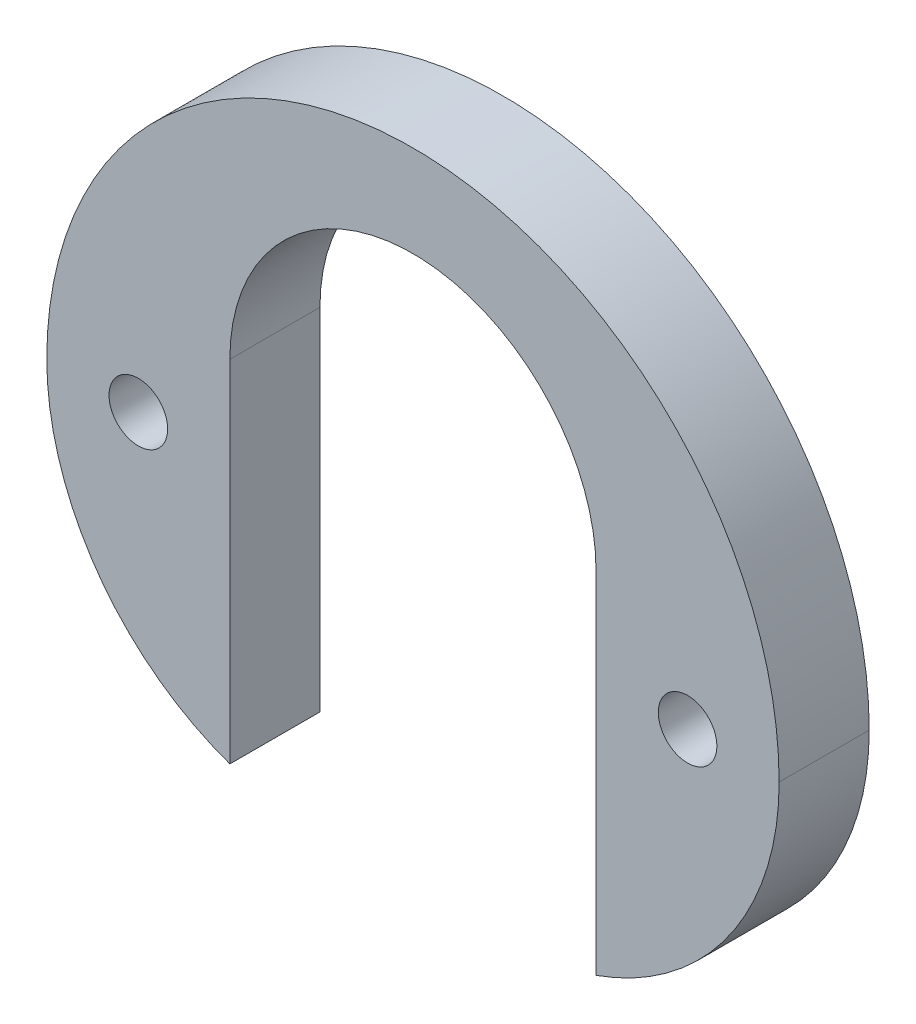
ISO-10303-21;
HEADER;
FILE_DESCRIPTION(('STEP AP214'),'2;1');
FILE_NAME('part.step','',(''),(''),'','','');
FILE_SCHEMA(('AUTOMOTIVE_DESIGN { 1 0 10303 214 1 1 1 1 }'));
ENDSEC;
DATA;
#1=APPLICATION_CONTEXT('core data for automotive mechanical design processes');
#2=APPLICATION_PROTOCOL_DEFINITION('international standard','automotive_design',2000,#1);
#3=PRODUCT_CONTEXT('',#1,'mechanical');
#4=PRODUCT('Part','Part','',(#3));
#5=PRODUCT_RELATED_PRODUCT_CATEGORY('part','',(#4));
#6=PRODUCT_DEFINITION_FORMATION('','',#4);
#7=PRODUCT_DEFINITION_CONTEXT('part definition',#1,'design');
#8=PRODUCT_DEFINITION('design','',#6,#7);
#9=PRODUCT_DEFINITION_SHAPE('','',#8);
#10=(LENGTH_UNIT() NAMED_UNIT(*) SI_UNIT(.MILLI.,.METRE.));
#11=(NAMED_UNIT(*) PLANE_ANGLE_UNIT() SI_UNIT($,.RADIAN.));
#12=(NAMED_UNIT(*) SI_UNIT($,.STERADIAN.) SOLID_ANGLE_UNIT());
#13=UNCERTAINTY_MEASURE_WITH_UNIT(LENGTH_MEASURE(1.E-05),#10,'distance_accuracy_value','');
#14=(GEOMETRIC_REPRESENTATION_CONTEXT(3) GLOBAL_UNCERTAINTY_ASSIGNED_CONTEXT((#13)) GLOBAL_UNIT_ASSIGNED_CONTEXT((#10,
#11,#12)) REPRESENTATION_CONTEXT('',''));
#15=CARTESIAN_POINT('',(0.,0.,0.));
#16=DIRECTION('',(0.,0.,1.));
#17=DIRECTION('',(1.,0.,0.));
#18=AXIS2_PLACEMENT_3D('',#15,#16,#17);
#19=CARTESIAN_POINT('',(0.,3.175,3.1242));
#20=DIRECTION('',(0.,0.,-1.));
#21=DIRECTION('',(-1.,0.,0.));
#22=AXIS2_PLACEMENT_3D('',#19,#20,#21);
#23=CYLINDRICAL_SURFACE('',#22,6.35);
#24=CARTESIAN_POINT('',(0.,3.175,0.));
#25=DIRECTION('',(0.,0.,1.));
#26=DIRECTION('',(1.,0.,0.));
#27=AXIS2_PLACEMENT_3D('',#24,#25,#26);
#28=CIRCLE('',#27,6.35);
#29=CARTESIAN_POINT('',(6.35,3.175,0.));
#30=VERTEX_POINT('',#29);
#31=CARTESIAN_POINT('',(-6.35,3.17500000000001,0.));
#32=VERTEX_POINT('',#31);
#33=EDGE_CURVE('E127',#30,#32,#28,.T.);
#34=ORIENTED_EDGE('',*,*,#33,.F.);
#35=DIRECTION('',(0.,0.,-1.));
#36=VECTOR('',#35,1.);
#37=CARTESIAN_POINT('',(6.35,3.175,3.1242));
#38=LINE('',#37,#36);
#39=CARTESIAN_POINT('',(6.35,3.175,3.1242));
#40=VERTEX_POINT('',#39);
#41=EDGE_CURVE('E11',#40,#30,#38,.T.);
#42=ORIENTED_EDGE('',*,*,#41,.F.);
#43=CARTESIAN_POINT('',(0.,3.175,3.1242));
#44=DIRECTION('',(0.,0.,1.));
#45=DIRECTION('',(1.,0.,0.));
#46=AXIS2_PLACEMENT_3D('',#43,#44,#45);
#47=CIRCLE('',#46,6.35);
#48=CARTESIAN_POINT('',(-6.35,3.17500000000001,3.1242));
#49=VERTEX_POINT('',#48);
#50=EDGE_CURVE('E146',#40,#49,#47,.T.);
#51=ORIENTED_EDGE('',*,*,#50,.T.);
#52=DIRECTION('',(0.,0.,-1.));
#53=VECTOR('',#52,1.);
#54=CARTESIAN_POINT('',(-6.35,3.17500000000001,3.1242));
#55=LINE('',#54,#53);
#56=EDGE_CURVE('E53',#49,#32,#55,.T.);
#57=ORIENTED_EDGE('',*,*,#56,.T.);
#58=EDGE_LOOP('',(#34,#42,#51,#57));
#59=FACE_BOUND('',#58,.T.);
#60=ADVANCED_FACE('F37',(#59),#23,.F.);
#61=CARTESIAN_POINT('',(6.35,0.,3.1242));
#62=DIRECTION('',(1.,0.,0.));
#63=DIRECTION('',(0.,0.,-1.));
#64=AXIS2_PLACEMENT_3D('',#61,#62,#63);
#65=PLANE('',#64);
#66=DIRECTION('',(0.,-1.,0.));
#67=VECTOR('',#66,1.);
#68=CARTESIAN_POINT('',(6.35,0.,0.));
#69=LINE('',#68,#67);
#70=CARTESIAN_POINT('',(6.35,-8.98025612106916,0.));
#71=VERTEX_POINT('',#70);
#72=EDGE_CURVE('E129',#30,#71,#69,.T.);
#73=ORIENTED_EDGE('',*,*,#72,.T.);
#74=DIRECTION('',(0.,0.,-1.));
#75=VECTOR('',#74,1.);
#76=CARTESIAN_POINT('',(6.35,-8.98025612106916,3.1242));
#77=LINE('',#76,#75);
#78=CARTESIAN_POINT('',(6.35,-8.98025612106916,3.1242));
#79=VERTEX_POINT('',#78);
#80=EDGE_CURVE('E45',#79,#71,#77,.T.);
#81=ORIENTED_EDGE('',*,*,#80,.F.);
#82=DIRECTION('',(0.,-1.,0.));
#83=VECTOR('',#82,1.);
#84=CARTESIAN_POINT('',(6.35,0.,3.1242));
#85=LINE('',#84,#83);
#86=EDGE_CURVE('E116',#40,#79,#85,.T.);
#87=ORIENTED_EDGE('',*,*,#86,.F.);
#88=ORIENTED_EDGE('',*,*,#41,.T.);
#89=EDGE_LOOP('',(#73,#81,#87,#88));
#90=FACE_BOUND('',#89,.T.);
#91=ADVANCED_FACE('F174',(#90),#65,.F.);
#92=CARTESIAN_POINT('',(3.17500000000001,0.,3.1242));
#93=DIRECTION('',(0.,0.,-1.));
#94=DIRECTION('',(-1.,0.,0.));
#95=AXIS2_PLACEMENT_3D('',#92,#93,#94);
#96=CYLINDRICAL_SURFACE('',#95,9.525);
#97=CARTESIAN_POINT('',(3.17500000000001,0.,0.));
#98=DIRECTION('',(0.,0.,1.));
#99=DIRECTION('',(1.,0.,0.));
#100=AXIS2_PLACEMENT_3D('',#97,#98,#99);
#101=CIRCLE('',#100,9.525);
#102=CARTESIAN_POINT('',(12.7,0.,0.));
#103=VERTEX_POINT('',#102);
#104=EDGE_CURVE('E131',#71,#103,#101,.T.);
#105=ORIENTED_EDGE('',*,*,#104,.T.);
#106=DIRECTION('',(0.,0.,-1.));
#107=VECTOR('',#106,1.);
#108=CARTESIAN_POINT('',(12.7,0.,3.1242));
#109=LINE('',#108,#107);
#110=CARTESIAN_POINT('',(12.7,0.,3.1242));
#111=VERTEX_POINT('',#110);
#112=EDGE_CURVE('E101',#111,#103,#109,.T.);
#113=ORIENTED_EDGE('',*,*,#112,.F.);
#114=CARTESIAN_POINT('',(3.17500000000001,0.,3.1242));
#115=DIRECTION('',(0.,0.,1.));
#116=DIRECTION('',(1.,0.,0.));
#117=AXIS2_PLACEMENT_3D('',#114,#115,#116);
#118=CIRCLE('',#117,9.525);
#119=EDGE_CURVE('E113',#79,#111,#118,.T.);
#120=ORIENTED_EDGE('',*,*,#119,.F.);
#121=ORIENTED_EDGE('',*,*,#80,.T.);
#122=EDGE_LOOP('',(#105,#113,#120,#121));
#123=FACE_BOUND('',#122,.T.);
#124=ADVANCED_FACE('F153',(#123),#96,.T.);
#125=CARTESIAN_POINT('',(0.,0.,3.1242));
#126=DIRECTION('',(0.,0.,-1.));
#127=DIRECTION('',(-1.,0.,0.));
#128=AXIS2_PLACEMENT_3D('',#125,#126,#127);
#129=CYLINDRICAL_SURFACE('',#128,12.7);
#130=CARTESIAN_POINT('',(0.,0.,0.));
#131=DIRECTION('',(0.,0.,1.));
#132=DIRECTION('',(1.,0.,0.));
#133=AXIS2_PLACEMENT_3D('',#130,#131,#132);
#134=CIRCLE('',#133,12.7);
#135=CARTESIAN_POINT('',(-12.7,0.,0.));
#136=VERTEX_POINT('',#135);
#137=EDGE_CURVE('E98',#136,#103,#134,.F.);
#138=ORIENTED_EDGE('',*,*,#137,.F.);
#139=DIRECTION('',(0.,0.,-1.));
#140=VECTOR('',#139,1.);
#141=CARTESIAN_POINT('',(-12.7,0.,3.1242));
#142=LINE('',#141,#140);
#143=CARTESIAN_POINT('',(-12.7,0.,3.1242));
#144=VERTEX_POINT('',#143);
#145=EDGE_CURVE('E92',#144,#136,#142,.T.);
#146=ORIENTED_EDGE('',*,*,#145,.F.);
#147=CARTESIAN_POINT('',(0.,0.,3.1242));
#148=DIRECTION('',(0.,0.,1.));
#149=DIRECTION('',(1.,0.,0.));
#150=AXIS2_PLACEMENT_3D('',#147,#148,#149);
#151=CIRCLE('',#150,12.7);
#152=EDGE_CURVE('E96',#144,#111,#151,.F.);
#153=ORIENTED_EDGE('',*,*,#152,.T.);
#154=ORIENTED_EDGE('',*,*,#112,.T.);
#155=EDGE_LOOP('',(#138,#146,#153,#154));
#156=FACE_BOUND('',#155,.T.);
#157=ADVANCED_FACE('F94',(#156),#129,.T.);
#158=CARTESIAN_POINT('',(-3.175,0.,3.1242));
#159=DIRECTION('',(0.,0.,-1.));
#160=DIRECTION('',(-1.,0.,0.));
#161=AXIS2_PLACEMENT_3D('',#158,#159,#160);
#162=CYLINDRICAL_SURFACE('',#161,9.525);
#163=CARTESIAN_POINT('',(-3.175,0.,0.));
#164=DIRECTION('',(0.,0.,1.));
#165=DIRECTION('',(1.,0.,0.));
#166=AXIS2_PLACEMENT_3D('',#163,#164,#165);
#167=CIRCLE('',#166,9.525);
#168=CARTESIAN_POINT('',(-6.35,-8.98025612106916,0.));
#169=VERTEX_POINT('',#168);
#170=EDGE_CURVE('E135',#136,#169,#167,.T.);
#171=ORIENTED_EDGE('',*,*,#170,.T.);
#172=DIRECTION('',(0.,0.,-1.));
#173=VECTOR('',#172,1.);
#174=CARTESIAN_POINT('',(-6.35,-8.98025612106916,3.1242));
#175=LINE('',#174,#173);
#176=CARTESIAN_POINT('',(-6.35,-8.98025612106916,3.1242));
#177=VERTEX_POINT('',#176);
#178=EDGE_CURVE('E73',#177,#169,#175,.T.);
#179=ORIENTED_EDGE('',*,*,#178,.F.);
#180=CARTESIAN_POINT('',(-3.175,0.,3.1242));
#181=DIRECTION('',(0.,0.,1.));
#182=DIRECTION('',(1.,0.,0.));
#183=AXIS2_PLACEMENT_3D('',#180,#181,#182);
#184=CIRCLE('',#183,9.525);
#185=EDGE_CURVE('E103',#144,#177,#184,.T.);
#186=ORIENTED_EDGE('',*,*,#185,.F.);
#187=ORIENTED_EDGE('',*,*,#145,.T.);
#188=EDGE_LOOP('',(#171,#179,#186,#187));
#189=FACE_BOUND('',#188,.T.);
#190=ADVANCED_FACE('F104',(#189),#162,.T.);
#191=CARTESIAN_POINT('',(-9.525,0.,3.1242));
#192=DIRECTION('',(0.,0.,-1.));
#193=DIRECTION('',(-1.,0.,0.));
#194=AXIS2_PLACEMENT_3D('',#191,#192,#193);
#195=CYLINDRICAL_SURFACE('',#194,1.016);
#196=CARTESIAN_POINT('',(-9.525,0.,3.1242));
#197=DIRECTION('',(0.,0.,1.));
#198=DIRECTION('',(1.,0.,0.));
#199=AXIS2_PLACEMENT_3D('',#196,#197,#198);
#200=CIRCLE('',#199,1.016);
#201=CARTESIAN_POINT('',(-8.509,0.,3.1242));
#202=VERTEX_POINT('',#201);
#203=EDGE_CURVE('E121',#202,#202,#200,.T.);
#204=ORIENTED_EDGE('',*,*,#203,.T.);
#205=EDGE_LOOP('',(#204));
#206=FACE_BOUND('',#205,.T.);
#207=CARTESIAN_POINT('',(-9.525,0.,0.));
#208=DIRECTION('',(0.,0.,1.));
#209=DIRECTION('',(1.,0.,0.));
#210=AXIS2_PLACEMENT_3D('',#207,#208,#209);
#211=CIRCLE('',#210,1.016);
#212=CARTESIAN_POINT('',(-8.509,0.,0.));
#213=VERTEX_POINT('',#212);
#214=EDGE_CURVE('E140',#213,#213,#211,.T.);
#215=ORIENTED_EDGE('',*,*,#214,.F.);
#216=EDGE_LOOP('',(#215));
#217=FACE_BOUND('',#216,.T.);
#218=ADVANCED_FACE('F162',(#206,#217),#195,.F.);
#219=CARTESIAN_POINT('',(-6.35,0.,3.1242));
#220=DIRECTION('',(1.,0.,0.));
#221=DIRECTION('',(0.,0.,-1.));
#222=AXIS2_PLACEMENT_3D('',#219,#220,#221);
#223=PLANE('',#222);
#224=DIRECTION('',(0.,-1.,0.));
#225=VECTOR('',#224,1.);
#226=CARTESIAN_POINT('',(-6.35,0.,0.));
#227=LINE('',#226,#225);
#228=EDGE_CURVE('E137',#32,#169,#227,.T.);
#229=ORIENTED_EDGE('',*,*,#228,.F.);
#230=ORIENTED_EDGE('',*,*,#56,.F.);
#231=DIRECTION('',(0.,-1.,0.));
#232=VECTOR('',#231,1.);
#233=CARTESIAN_POINT('',(-6.35,0.,3.1242));
#234=LINE('',#233,#232);
#235=EDGE_CURVE('E107',#49,#177,#234,.T.);
#236=ORIENTED_EDGE('',*,*,#235,.T.);
#237=ORIENTED_EDGE('',*,*,#178,.T.);
#238=EDGE_LOOP('',(#229,#230,#236,#237));
#239=FACE_BOUND('',#238,.T.);
#240=ADVANCED_FACE('F159',(#239),#223,.T.);
#241=CARTESIAN_POINT('',(9.52500000000001,0.,3.1242));
#242=DIRECTION('',(0.,0.,-1.));
#243=DIRECTION('',(-1.,0.,0.));
#244=AXIS2_PLACEMENT_3D('',#241,#242,#243);
#245=CYLINDRICAL_SURFACE('',#244,1.016);
#246=CARTESIAN_POINT('',(9.52500000000001,0.,3.1242));
#247=DIRECTION('',(0.,0.,1.));
#248=DIRECTION('',(1.,0.,0.));
#249=AXIS2_PLACEMENT_3D('',#246,#247,#248);
#250=CIRCLE('',#249,1.016);
#251=CARTESIAN_POINT('',(10.541,0.,3.1242));
#252=VERTEX_POINT('',#251);
#253=EDGE_CURVE('E124',#252,#252,#250,.T.);
#254=ORIENTED_EDGE('',*,*,#253,.T.);
#255=EDGE_LOOP('',(#254));
#256=FACE_BOUND('',#255,.T.);
#257=CARTESIAN_POINT('',(9.52500000000001,0.,0.));
#258=DIRECTION('',(0.,0.,1.));
#259=DIRECTION('',(1.,0.,0.));
#260=AXIS2_PLACEMENT_3D('',#257,#258,#259);
#261=CIRCLE('',#260,1.016);
#262=CARTESIAN_POINT('',(10.541,0.,0.));
#263=VERTEX_POINT('',#262);
#264=EDGE_CURVE('E143',#263,#263,#261,.T.);
#265=ORIENTED_EDGE('',*,*,#264,.F.);
#266=EDGE_LOOP('',(#265));
#267=FACE_BOUND('',#266,.T.);
#268=ADVANCED_FACE('F161',(#256,#267),#245,.F.);
#269=CARTESIAN_POINT('',(0.,0.,3.1242));
#270=DIRECTION('',(0.,0.,1.));
#271=DIRECTION('',(1.,0.,0.));
#272=AXIS2_PLACEMENT_3D('',#269,#270,#271);
#273=PLANE('',#272);
#274=ORIENTED_EDGE('',*,*,#50,.F.);
#275=ORIENTED_EDGE('',*,*,#86,.T.);
#276=ORIENTED_EDGE('',*,*,#119,.T.);
#277=ORIENTED_EDGE('',*,*,#152,.F.);
#278=ORIENTED_EDGE('',*,*,#185,.T.);
#279=ORIENTED_EDGE('',*,*,#235,.F.);
#280=EDGE_LOOP('',(#274,#275,#276,#277,#278,#279));
#281=FACE_BOUND('',#280,.T.);
#282=ORIENTED_EDGE('',*,*,#203,.F.);
#283=EDGE_LOOP('',(#282));
#284=FACE_BOUND('',#283,.T.);
#285=ORIENTED_EDGE('',*,*,#253,.F.);
#286=EDGE_LOOP('',(#285));
#287=FACE_BOUND('',#286,.T.);
#288=ADVANCED_FACE('F110',(#281,#284,#287),#273,.T.);
#289=CARTESIAN_POINT('',(0.,0.,0.));
#290=DIRECTION('',(0.,0.,1.));
#291=DIRECTION('',(1.,0.,0.));
#292=AXIS2_PLACEMENT_3D('',#289,#290,#291);
#293=PLANE('',#292);
#294=ORIENTED_EDGE('',*,*,#33,.T.);
#295=ORIENTED_EDGE('',*,*,#228,.T.);
#296=ORIENTED_EDGE('',*,*,#170,.F.);
#297=ORIENTED_EDGE('',*,*,#137,.T.);
#298=ORIENTED_EDGE('',*,*,#104,.F.);
#299=ORIENTED_EDGE('',*,*,#72,.F.);
#300=EDGE_LOOP('',(#294,#295,#296,#297,#298,#299));
#301=FACE_BOUND('',#300,.T.);
#302=ORIENTED_EDGE('',*,*,#214,.T.);
#303=EDGE_LOOP('',(#302));
#304=FACE_BOUND('',#303,.T.);
#305=ORIENTED_EDGE('',*,*,#264,.T.);
#306=EDGE_LOOP('',(#305));
#307=FACE_BOUND('',#306,.T.);
#308=ADVANCED_FACE('F157',(#301,#304,#307),#293,.F.);
#309=CLOSED_SHELL('',(#60,#91,#124,#157,#190,#218,#240,#268,#288,#308));
#310=MANIFOLD_SOLID_BREP('B2',#309);
#311=ADVANCED_BREP_SHAPE_REPRESENTATION('',(#18,#310),#14);
#312=SHAPE_DEFINITION_REPRESENTATION(#9,#311);
ENDSEC;
END-ISO-10303-21;
